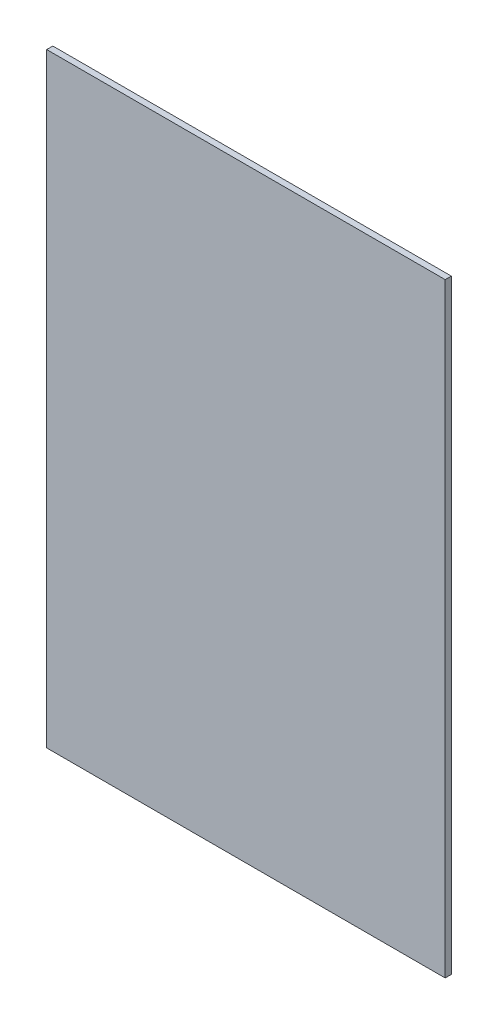
ISO-10303-21;
HEADER;
FILE_DESCRIPTION(('STEP AP214'),'2;1');
FILE_NAME('part.step','',(''),(''),'','','');
FILE_SCHEMA(('AUTOMOTIVE_DESIGN { 1 0 10303 214 1 1 1 1 }'));
ENDSEC;
DATA;
#1=APPLICATION_CONTEXT('core data for automotive mechanical design processes');
#2=APPLICATION_PROTOCOL_DEFINITION('international standard','automotive_design',2000,#1);
#3=PRODUCT_CONTEXT('',#1,'mechanical');
#4=PRODUCT('Part','Part','',(#3));
#5=PRODUCT_RELATED_PRODUCT_CATEGORY('part','',(#4));
#6=PRODUCT_DEFINITION_FORMATION('','',#4);
#7=PRODUCT_DEFINITION_CONTEXT('part definition',#1,'design');
#8=PRODUCT_DEFINITION('design','',#6,#7);
#9=PRODUCT_DEFINITION_SHAPE('','',#8);
#10=(LENGTH_UNIT() NAMED_UNIT(*) SI_UNIT(.MILLI.,.METRE.));
#11=(NAMED_UNIT(*) PLANE_ANGLE_UNIT() SI_UNIT($,.RADIAN.));
#12=(NAMED_UNIT(*) SI_UNIT($,.STERADIAN.) SOLID_ANGLE_UNIT());
#13=UNCERTAINTY_MEASURE_WITH_UNIT(LENGTH_MEASURE(1.E-05),#10,'distance_accuracy_value','');
#14=(GEOMETRIC_REPRESENTATION_CONTEXT(3) GLOBAL_UNCERTAINTY_ASSIGNED_CONTEXT((#13)) GLOBAL_UNIT_ASSIGNED_CONTEXT((#10,
#11,#12)) REPRESENTATION_CONTEXT('',''));
#15=CARTESIAN_POINT('',(0.,0.,0.));
#16=DIRECTION('',(0.,0.,1.));
#17=DIRECTION('',(1.,0.,0.));
#18=AXIS2_PLACEMENT_3D('',#15,#16,#17);
#19=CARTESIAN_POINT('',(-130.,130.,4.));
#20=DIRECTION('',(1.,0.,0.));
#21=DIRECTION('',(0.,1.,0.));
#22=AXIS2_PLACEMENT_3D('',#19,#20,#21);
#23=PLANE('',#22);
#24=DIRECTION('',(0.,-1.,0.));
#25=VECTOR('',#24,1.);
#26=CARTESIAN_POINT('',(-130.,130.,0.));
#27=LINE('',#26,#25);
#28=CARTESIAN_POINT('',(-130.,130.,0.));
#29=VERTEX_POINT('',#28);
#30=CARTESIAN_POINT('',(-130.,-264.6,0.));
#31=VERTEX_POINT('',#30);
#32=EDGE_CURVE('E97',#29,#31,#27,.T.);
#33=ORIENTED_EDGE('',*,*,#32,.T.);
#34=DIRECTION('',(0.,0.,-1.));
#35=VECTOR('',#34,1.);
#36=CARTESIAN_POINT('',(-130.,-264.6,4.));
#37=LINE('',#36,#35);
#38=CARTESIAN_POINT('',(-130.,-264.6,4.));
#39=VERTEX_POINT('',#38);
#40=EDGE_CURVE('E11',#39,#31,#37,.T.);
#41=ORIENTED_EDGE('',*,*,#40,.F.);
#42=DIRECTION('',(0.,-1.,0.));
#43=VECTOR('',#42,1.);
#44=CARTESIAN_POINT('',(-130.,130.,4.));
#45=LINE('',#44,#43);
#46=CARTESIAN_POINT('',(-130.,130.,4.));
#47=VERTEX_POINT('',#46);
#48=EDGE_CURVE('E85',#47,#39,#45,.T.);
#49=ORIENTED_EDGE('',*,*,#48,.F.);
#50=DIRECTION('',(0.,0.,-1.));
#51=VECTOR('',#50,1.);
#52=CARTESIAN_POINT('',(-130.,130.,4.));
#53=LINE('',#52,#51);
#54=EDGE_CURVE('E93',#47,#29,#53,.T.);
#55=ORIENTED_EDGE('',*,*,#54,.T.);
#56=EDGE_LOOP('',(#33,#41,#49,#55));
#57=FACE_BOUND('',#56,.T.);
#58=ADVANCED_FACE('F34',(#57),#23,.F.);
#59=CARTESIAN_POINT('',(-130.,-264.6,4.));
#60=DIRECTION('',(0.,1.,0.));
#61=DIRECTION('',(0.,0.,1.));
#62=AXIS2_PLACEMENT_3D('',#59,#60,#61);
#63=PLANE('',#62);
#64=DIRECTION('',(1.,0.,0.));
#65=VECTOR('',#64,1.);
#66=CARTESIAN_POINT('',(-130.,-264.6,0.));
#67=LINE('',#66,#65);
#68=CARTESIAN_POINT('',(130.,-264.6,0.));
#69=VERTEX_POINT('',#68);
#70=EDGE_CURVE('E89',#31,#69,#67,.T.);
#71=ORIENTED_EDGE('',*,*,#70,.T.);
#72=DIRECTION('',(0.,0.,-1.));
#73=VECTOR('',#72,1.);
#74=CARTESIAN_POINT('',(130.,-264.6,4.));
#75=LINE('',#74,#73);
#76=CARTESIAN_POINT('',(130.,-264.6,4.));
#77=VERTEX_POINT('',#76);
#78=EDGE_CURVE('E42',#77,#69,#75,.T.);
#79=ORIENTED_EDGE('',*,*,#78,.F.);
#80=DIRECTION('',(1.,0.,0.));
#81=VECTOR('',#80,1.);
#82=CARTESIAN_POINT('',(-130.,-264.6,4.));
#83=LINE('',#82,#81);
#84=EDGE_CURVE('E80',#39,#77,#83,.T.);
#85=ORIENTED_EDGE('',*,*,#84,.F.);
#86=ORIENTED_EDGE('',*,*,#40,.T.);
#87=EDGE_LOOP('',(#71,#79,#85,#86));
#88=FACE_BOUND('',#87,.T.);
#89=ADVANCED_FACE('F88',(#88),#63,.F.);
#90=CARTESIAN_POINT('',(130.,130.,4.));
#91=DIRECTION('',(-1.,0.,0.));
#92=DIRECTION('',(0.,-1.,0.));
#93=AXIS2_PLACEMENT_3D('',#90,#91,#92);
#94=PLANE('',#93);
#95=DIRECTION('',(0.,1.,0.));
#96=VECTOR('',#95,1.);
#97=CARTESIAN_POINT('',(130.,130.,0.));
#98=LINE('',#97,#96);
#99=CARTESIAN_POINT('',(130.,130.,0.));
#100=VERTEX_POINT('',#99);
#101=EDGE_CURVE('E67',#69,#100,#98,.T.);
#102=ORIENTED_EDGE('',*,*,#101,.T.);
#103=DIRECTION('',(0.,0.,-1.));
#104=VECTOR('',#103,1.);
#105=CARTESIAN_POINT('',(130.,130.,4.));
#106=LINE('',#105,#104);
#107=CARTESIAN_POINT('',(130.,130.,4.));
#108=VERTEX_POINT('',#107);
#109=EDGE_CURVE('E90',#108,#100,#106,.T.);
#110=ORIENTED_EDGE('',*,*,#109,.F.);
#111=DIRECTION('',(0.,1.,0.));
#112=VECTOR('',#111,1.);
#113=CARTESIAN_POINT('',(130.,130.,4.));
#114=LINE('',#113,#112);
#115=EDGE_CURVE('E83',#77,#108,#114,.T.);
#116=ORIENTED_EDGE('',*,*,#115,.F.);
#117=ORIENTED_EDGE('',*,*,#78,.T.);
#118=EDGE_LOOP('',(#102,#110,#116,#117));
#119=FACE_BOUND('',#118,.T.);
#120=ADVANCED_FACE('F91',(#119),#94,.F.);
#121=CARTESIAN_POINT('',(-130.,130.,4.));
#122=DIRECTION('',(0.,-1.,0.));
#123=DIRECTION('',(1.,0.,0.));
#124=AXIS2_PLACEMENT_3D('',#121,#122,#123);
#125=PLANE('',#124);
#126=DIRECTION('',(-1.,0.,0.));
#127=VECTOR('',#126,1.);
#128=CARTESIAN_POINT('',(-130.,130.,0.));
#129=LINE('',#128,#127);
#130=EDGE_CURVE('E73',#100,#29,#129,.T.);
#131=ORIENTED_EDGE('',*,*,#130,.T.);
#132=ORIENTED_EDGE('',*,*,#54,.F.);
#133=DIRECTION('',(-1.,0.,0.));
#134=VECTOR('',#133,1.);
#135=CARTESIAN_POINT('',(-130.,130.,4.));
#136=LINE('',#135,#134);
#137=EDGE_CURVE('E50',#108,#47,#136,.T.);
#138=ORIENTED_EDGE('',*,*,#137,.F.);
#139=ORIENTED_EDGE('',*,*,#109,.T.);
#140=EDGE_LOOP('',(#131,#132,#138,#139));
#141=FACE_BOUND('',#140,.T.);
#142=ADVANCED_FACE('F104',(#141),#125,.F.);
#143=CARTESIAN_POINT('',(0.,0.,4.));
#144=DIRECTION('',(0.,0.,1.));
#145=DIRECTION('',(1.,0.,0.));
#146=AXIS2_PLACEMENT_3D('',#143,#144,#145);
#147=PLANE('',#146);
#148=ORIENTED_EDGE('',*,*,#48,.T.);
#149=ORIENTED_EDGE('',*,*,#84,.T.);
#150=ORIENTED_EDGE('',*,*,#115,.T.);
#151=ORIENTED_EDGE('',*,*,#137,.T.);
#152=EDGE_LOOP('',(#148,#149,#150,#151));
#153=FACE_BOUND('',#152,.T.);
#154=ADVANCED_FACE('F81',(#153),#147,.T.);
#155=CARTESIAN_POINT('',(0.,0.,0.));
#156=DIRECTION('',(0.,0.,1.));
#157=DIRECTION('',(1.,0.,0.));
#158=AXIS2_PLACEMENT_3D('',#155,#156,#157);
#159=PLANE('',#158);
#160=ORIENTED_EDGE('',*,*,#32,.F.);
#161=ORIENTED_EDGE('',*,*,#130,.F.);
#162=ORIENTED_EDGE('',*,*,#101,.F.);
#163=ORIENTED_EDGE('',*,*,#70,.F.);
#164=EDGE_LOOP('',(#160,#161,#162,#163));
#165=FACE_BOUND('',#164,.T.);
#166=ADVANCED_FACE('F107',(#165),#159,.F.);
#167=CLOSED_SHELL('',(#58,#89,#120,#142,#154,#166));
#168=MANIFOLD_SOLID_BREP('B2',#167);
#169=ADVANCED_BREP_SHAPE_REPRESENTATION('',(#18,#168),#14);
#170=SHAPE_DEFINITION_REPRESENTATION(#9,#169);
ENDSEC;
END-ISO-10303-21;
